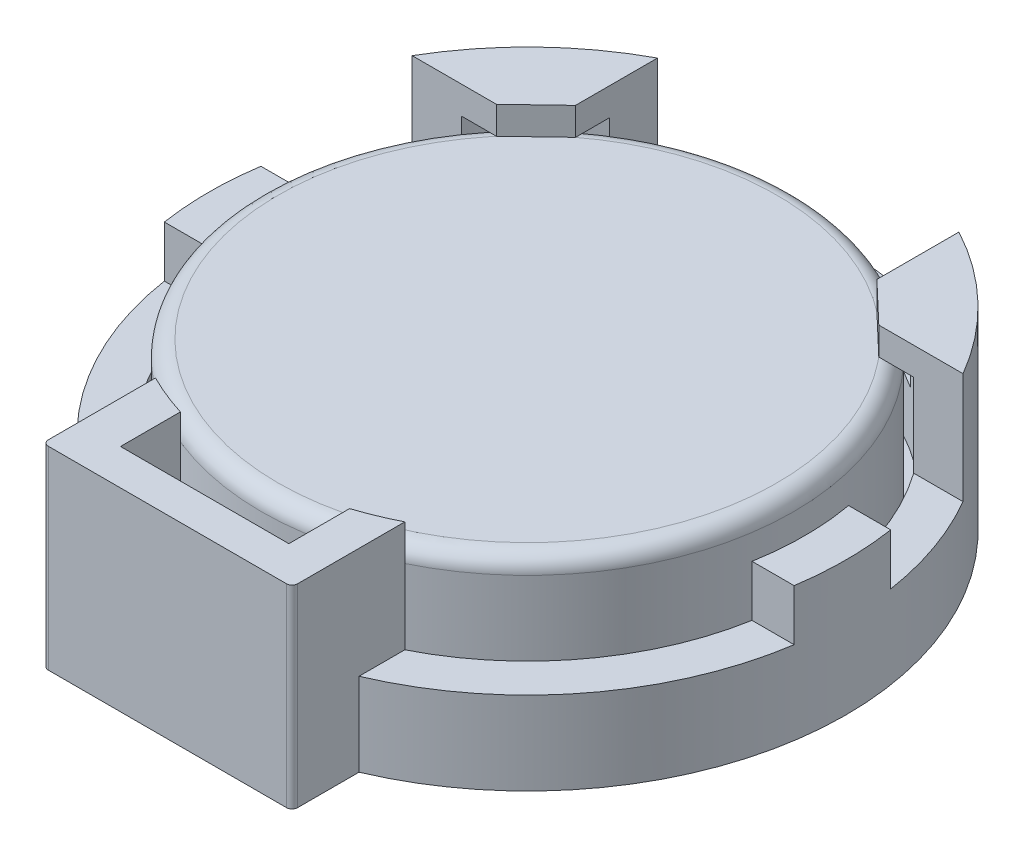
ISO-10303-21;
HEADER;
FILE_DESCRIPTION(('STEP AP214'),'2;1');
FILE_NAME('part.step','',(''),(''),'','','');
FILE_SCHEMA(('AUTOMOTIVE_DESIGN { 1 0 10303 214 1 1 1 1 }'));
ENDSEC;
DATA;
#1=APPLICATION_CONTEXT('core data for automotive mechanical design processes');
#2=APPLICATION_PROTOCOL_DEFINITION('international standard','automotive_design',2000,#1);
#3=PRODUCT_CONTEXT('',#1,'mechanical');
#4=PRODUCT('Part','Part','',(#3));
#5=PRODUCT_RELATED_PRODUCT_CATEGORY('part','',(#4));
#6=PRODUCT_DEFINITION_FORMATION('','',#4);
#7=PRODUCT_DEFINITION_CONTEXT('part definition',#1,'design');
#8=PRODUCT_DEFINITION('design','',#6,#7);
#9=PRODUCT_DEFINITION_SHAPE('','',#8);
#10=(LENGTH_UNIT() NAMED_UNIT(*) SI_UNIT(.MILLI.,.METRE.));
#11=(NAMED_UNIT(*) PLANE_ANGLE_UNIT() SI_UNIT($,.RADIAN.));
#12=(NAMED_UNIT(*) SI_UNIT($,.STERADIAN.) SOLID_ANGLE_UNIT());
#13=UNCERTAINTY_MEASURE_WITH_UNIT(LENGTH_MEASURE(1.E-05),#10,'distance_accuracy_value','');
#14=(GEOMETRIC_REPRESENTATION_CONTEXT(3) GLOBAL_UNCERTAINTY_ASSIGNED_CONTEXT((#13)) GLOBAL_UNIT_ASSIGNED_CONTEXT((#10,
#11,#12)) REPRESENTATION_CONTEXT('',''));
#15=CARTESIAN_POINT('',(0.,0.,0.));
#16=DIRECTION('',(0.,0.,1.));
#17=DIRECTION('',(1.,0.,0.));
#18=AXIS2_PLACEMENT_3D('',#15,#16,#17);
#19=CARTESIAN_POINT('',(0.,1.,0.));
#20=DIRECTION('',(0.,1.,0.));
#21=DIRECTION('',(0.,0.,1.));
#22=AXIS2_PLACEMENT_3D('',#19,#20,#21);
#23=CYLINDRICAL_SURFACE('',#22,10.);
#24=CARTESIAN_POINT('',(0.,1.,0.));
#25=DIRECTION('',(0.,1.,0.));
#26=DIRECTION('',(0.,0.,1.));
#27=AXIS2_PLACEMENT_3D('',#24,#25,#26);
#28=CIRCLE('',#27,10.);
#29=CARTESIAN_POINT('',(0.,1.,10.));
#30=VERTEX_POINT('',#29);
#31=EDGE_CURVE('E454',#30,#30,#28,.T.);
#32=ORIENTED_EDGE('',*,*,#31,.F.);
#33=EDGE_LOOP('',(#32));
#34=FACE_BOUND('',#33,.T.);
#35=CARTESIAN_POINT('',(0.,6.,0.));
#36=DIRECTION('',(0.,1.,0.));
#37=DIRECTION('',(0.,0.,1.));
#38=AXIS2_PLACEMENT_3D('',#35,#36,#37);
#39=CIRCLE('',#38,10.);
#40=CARTESIAN_POINT('',(8.16170008433562,6.,-5.77811835577604));
#41=VERTEX_POINT('',#40);
#42=CARTESIAN_POINT('',(5.44030687455703,6.,-8.39065319928357));
#43=VERTEX_POINT('',#42);
#44=EDGE_CURVE('E279',#41,#43,#39,.T.);
#45=ORIENTED_EDGE('',*,*,#44,.T.);
#46=DIRECTION('',(0.,1.,0.));
#47=VECTOR('',#46,1.);
#48=CARTESIAN_POINT('',(5.44030687455703,1.,-8.39065319928357));
#49=LINE('',#48,#47);
#50=CARTESIAN_POINT('',(5.44030687455703,3.,-8.39065319928357));
#51=VERTEX_POINT('',#50);
#52=EDGE_CURVE('E269',#43,#51,#49,.F.);
#53=ORIENTED_EDGE('',*,*,#52,.T.);
#54=CARTESIAN_POINT('',(0.,3.,0.));
#55=DIRECTION('',(0.,1.,0.));
#56=DIRECTION('',(0.,0.,1.));
#57=AXIS2_PLACEMENT_3D('',#54,#55,#56);
#58=CIRCLE('',#57,10.);
#59=CARTESIAN_POINT('',(-5.44030687455703,3.,-8.39065319928357));
#60=VERTEX_POINT('',#59);
#61=EDGE_CURVE('E277',#60,#51,#58,.F.);
#62=ORIENTED_EDGE('',*,*,#61,.F.);
#63=DIRECTION('',(0.,1.,0.));
#64=VECTOR('',#63,1.);
#65=CARTESIAN_POINT('',(-5.44030687455703,1.,-8.39065319928357));
#66=LINE('',#65,#64);
#67=CARTESIAN_POINT('',(-5.44030687455703,6.,-8.39065319928357));
#68=VERTEX_POINT('',#67);
#69=EDGE_CURVE('E68',#60,#68,#66,.T.);
#70=ORIENTED_EDGE('',*,*,#69,.T.);
#71=CARTESIAN_POINT('',(0.,6.,0.));
#72=DIRECTION('',(0.,1.,0.));
#73=DIRECTION('',(0.,0.,-1.));
#74=AXIS2_PLACEMENT_3D('',#71,#72,#73);
#75=CIRCLE('',#74,10.);
#76=CARTESIAN_POINT('',(-8.16170008433562,6.,-5.77811835577604));
#77=VERTEX_POINT('',#76);
#78=EDGE_CURVE('E302',#68,#77,#75,.T.);
#79=ORIENTED_EDGE('',*,*,#78,.T.);
#80=DIRECTION('',(0.,1.,0.));
#81=VECTOR('',#80,1.);
#82=CARTESIAN_POINT('',(-8.16170008433562,1.,-5.77811835577604));
#83=LINE('',#82,#81);
#84=CARTESIAN_POINT('',(-8.16170008433561,3.,-5.77811835577604));
#85=VERTEX_POINT('',#84);
#86=EDGE_CURVE('E473',#77,#85,#83,.F.);
#87=ORIENTED_EDGE('',*,*,#86,.T.);
#88=CARTESIAN_POINT('',(-9.84688215398306,3.,-1.74324749980313));
#89=VERTEX_POINT('',#88);
#90=EDGE_CURVE('E468',#89,#85,#58,.F.);
#91=ORIENTED_EDGE('',*,*,#90,.F.);
#92=DIRECTION('',(0.,1.,0.));
#93=VECTOR('',#92,1.);
#94=CARTESIAN_POINT('',(-9.84688215398306,1.,-1.74324749980313));
#95=LINE('',#94,#93);
#96=CARTESIAN_POINT('',(-9.84688215398307,4.84705488621152,-1.74324749980313));
#97=VERTEX_POINT('',#96);
#98=EDGE_CURVE('E475',#89,#97,#95,.T.);
#99=ORIENTED_EDGE('',*,*,#98,.T.);
#100=CARTESIAN_POINT('',(0.,4.84705488621152,0.));
#101=DIRECTION('',(0.,-1.,0.));
#102=DIRECTION('',(0.,0.,-1.));
#103=AXIS2_PLACEMENT_3D('',#100,#101,#102);
#104=CIRCLE('',#103,10.);
#105=CARTESIAN_POINT('',(-9.84688215398306,4.84705488621152,1.74324749980313));
#106=VERTEX_POINT('',#105);
#107=EDGE_CURVE('E386',#97,#106,#104,.F.);
#108=ORIENTED_EDGE('',*,*,#107,.T.);
#109=DIRECTION('',(0.,1.,0.));
#110=VECTOR('',#109,1.);
#111=CARTESIAN_POINT('',(-9.84688215398306,1.,1.74324749980313));
#112=LINE('',#111,#110);
#113=CARTESIAN_POINT('',(-9.84688215398306,3.,1.74324749980313));
#114=VERTEX_POINT('',#113);
#115=EDGE_CURVE('E486',#106,#114,#112,.F.);
#116=ORIENTED_EDGE('',*,*,#115,.T.);
#117=CARTESIAN_POINT('',(0.,3.,0.));
#118=DIRECTION('',(0.,1.,0.));
#119=DIRECTION('',(0.,0.,1.));
#120=AXIS2_PLACEMENT_3D('',#117,#118,#119);
#121=CIRCLE('',#120,10.);
#122=CARTESIAN_POINT('',(-4.5,3.,8.93028554974588));
#123=VERTEX_POINT('',#122);
#124=EDGE_CURVE('E478',#123,#114,#121,.F.);
#125=ORIENTED_EDGE('',*,*,#124,.F.);
#126=DIRECTION('',(0.,-1.,0.));
#127=VECTOR('',#126,1.);
#128=CARTESIAN_POINT('',(-4.5,7.,8.93028554974588));
#129=LINE('',#128,#127);
#130=CARTESIAN_POINT('',(-4.5,7.,8.93028554974588));
#131=VERTEX_POINT('',#130);
#132=EDGE_CURVE('E355',#131,#123,#129,.T.);
#133=ORIENTED_EDGE('',*,*,#132,.F.);
#134=CARTESIAN_POINT('',(0.,7.,0.));
#135=DIRECTION('',(0.,-1.,0.));
#136=DIRECTION('',(0.,0.,-1.));
#137=AXIS2_PLACEMENT_3D('',#134,#135,#136);
#138=CIRCLE('',#137,10.);
#139=CARTESIAN_POINT('',(-2.9884242853768,7.,9.54302469296659));
#140=VERTEX_POINT('',#139);
#141=EDGE_CURVE('E353',#140,#131,#138,.T.);
#142=ORIENTED_EDGE('',*,*,#141,.F.);
#143=DIRECTION('',(0.,-1.,0.));
#144=VECTOR('',#143,1.);
#145=CARTESIAN_POINT('',(-2.9884242853768,7.,9.54302469296659));
#146=LINE('',#145,#144);
#147=CARTESIAN_POINT('',(-2.9884242853768,3.,9.54302469296659));
#148=VERTEX_POINT('',#147);
#149=EDGE_CURVE('E358',#140,#148,#146,.T.);
#150=ORIENTED_EDGE('',*,*,#149,.T.);
#151=CARTESIAN_POINT('',(3.08803842822269,3.,9.51125747027279));
#152=VERTEX_POINT('',#151);
#153=EDGE_CURVE('E483',#152,#148,#121,.F.);
#154=ORIENTED_EDGE('',*,*,#153,.F.);
#155=DIRECTION('',(0.,-1.,0.));
#156=VECTOR('',#155,1.);
#157=CARTESIAN_POINT('',(3.08803842822269,7.,9.51125747027279));
#158=LINE('',#157,#156);
#159=CARTESIAN_POINT('',(3.08803842822269,7.,9.51125747027279));
#160=VERTEX_POINT('',#159);
#161=EDGE_CURVE('E366',#160,#152,#158,.T.);
#162=ORIENTED_EDGE('',*,*,#161,.F.);
#163=CARTESIAN_POINT('',(0.,7.,0.));
#164=DIRECTION('',(0.,-1.,0.));
#165=DIRECTION('',(0.,0.,-1.));
#166=AXIS2_PLACEMENT_3D('',#163,#164,#165);
#167=CIRCLE('',#166,10.);
#168=CARTESIAN_POINT('',(4.5,7.,8.93028554974588));
#169=VERTEX_POINT('',#168);
#170=EDGE_CURVE('E345',#169,#160,#167,.T.);
#171=ORIENTED_EDGE('',*,*,#170,.F.);
#172=DIRECTION('',(0.,-1.,0.));
#173=VECTOR('',#172,1.);
#174=CARTESIAN_POINT('',(4.5,7.,8.93028554974588));
#175=LINE('',#174,#173);
#176=CARTESIAN_POINT('',(4.5,3.,8.93028554974588));
#177=VERTEX_POINT('',#176);
#178=EDGE_CURVE('E368',#169,#177,#175,.T.);
#179=ORIENTED_EDGE('',*,*,#178,.T.);
#180=CARTESIAN_POINT('',(9.84688215398306,3.,1.74324749980313));
#181=VERTEX_POINT('',#180);
#182=EDGE_CURVE('E479',#181,#177,#121,.F.);
#183=ORIENTED_EDGE('',*,*,#182,.F.);
#184=DIRECTION('',(0.,1.,0.));
#185=VECTOR('',#184,1.);
#186=CARTESIAN_POINT('',(9.84688215398306,1.,1.74324749980313));
#187=LINE('',#186,#185);
#188=CARTESIAN_POINT('',(9.84688215398306,4.84705488621152,1.74324749980313));
#189=VERTEX_POINT('',#188);
#190=EDGE_CURVE('E482',#181,#189,#187,.T.);
#191=ORIENTED_EDGE('',*,*,#190,.T.);
#192=CARTESIAN_POINT('',(9.84688215398306,4.84705488621152,-1.74324749980313));
#193=VERTEX_POINT('',#192);
#194=EDGE_CURVE('E390',#189,#193,#104,.F.);
#195=ORIENTED_EDGE('',*,*,#194,.T.);
#196=DIRECTION('',(0.,1.,0.));
#197=VECTOR('',#196,1.);
#198=CARTESIAN_POINT('',(9.84688215398306,1.,-1.74324749980313));
#199=LINE('',#198,#197);
#200=CARTESIAN_POINT('',(9.84688215398306,3.,-1.74324749980313));
#201=VERTEX_POINT('',#200);
#202=EDGE_CURVE('E470',#193,#201,#199,.F.);
#203=ORIENTED_EDGE('',*,*,#202,.T.);
#204=CARTESIAN_POINT('',(8.16170008433562,3.,-5.77811835577604));
#205=VERTEX_POINT('',#204);
#206=EDGE_CURVE('E465',#205,#201,#58,.F.);
#207=ORIENTED_EDGE('',*,*,#206,.F.);
#208=DIRECTION('',(0.,1.,0.));
#209=VECTOR('',#208,1.);
#210=CARTESIAN_POINT('',(8.16170008433562,1.,-5.77811835577604));
#211=LINE('',#210,#209);
#212=EDGE_CURVE('E61',#205,#41,#211,.T.);
#213=ORIENTED_EDGE('',*,*,#212,.T.);
#214=EDGE_LOOP('',(#45,#53,#62,#70,#79,#87,#91,#99,#108,#116,#125,#133,#142,#150,#154,#162,#171,
#179,#183,#191,#195,#203,#207,#213));
#215=FACE_BOUND('',#214,.T.);
#216=ADVANCED_FACE('F46',(#34,#215),#23,.F.);
#217=CARTESIAN_POINT('',(0.,7.,0.));
#218=DIRECTION('',(0.,-1.,0.));
#219=DIRECTION('',(0.,0.,-1.));
#220=AXIS2_PLACEMENT_3D('',#217,#218,#219);
#221=CYLINDRICAL_SURFACE('',#220,11.5);
#222=DIRECTION('',(0.,-1.,0.));
#223=VECTOR('',#222,1.);
#224=CARTESIAN_POINT('',(-4.5,7.,10.5830052442584));
#225=LINE('',#224,#223);
#226=CARTESIAN_POINT('',(-4.5,3.,10.5830052442584));
#227=VERTEX_POINT('',#226);
#228=CARTESIAN_POINT('',(-4.5,0.,10.5830052442584));
#229=VERTEX_POINT('',#228);
#230=EDGE_CURVE('E378',#227,#229,#225,.T.);
#231=ORIENTED_EDGE('',*,*,#230,.F.);
#232=CARTESIAN_POINT('',(0.,3.,0.));
#233=DIRECTION('',(0.,1.,0.));
#234=DIRECTION('',(0.,0.,1.));
#235=AXIS2_PLACEMENT_3D('',#232,#233,#234);
#236=CIRCLE('',#235,11.5);
#237=CARTESIAN_POINT('',(-11.3671055310677,3.,1.74324749980313));
#238=VERTEX_POINT('',#237);
#239=EDGE_CURVE('E401',#238,#227,#236,.T.);
#240=ORIENTED_EDGE('',*,*,#239,.F.);
#241=DIRECTION('',(0.,-1.,0.));
#242=VECTOR('',#241,1.);
#243=CARTESIAN_POINT('',(-11.3671055310677,7.,1.74324749980313));
#244=LINE('',#243,#242);
#245=CARTESIAN_POINT('',(-11.3671055310677,4.84705488621152,1.74324749980313));
#246=VERTEX_POINT('',#245);
#247=EDGE_CURVE('E404',#238,#246,#244,.F.);
#248=ORIENTED_EDGE('',*,*,#247,.T.);
#249=CARTESIAN_POINT('',(0.,4.84705488621152,0.));
#250=DIRECTION('',(0.,-1.,0.));
#251=DIRECTION('',(0.,0.,-1.));
#252=AXIS2_PLACEMENT_3D('',#249,#250,#251);
#253=CIRCLE('',#252,11.5);
#254=CARTESIAN_POINT('',(-11.3671055310677,4.84705488621152,-1.74324749980313));
#255=VERTEX_POINT('',#254);
#256=EDGE_CURVE('E389',#246,#255,#253,.T.);
#257=ORIENTED_EDGE('',*,*,#256,.T.);
#258=DIRECTION('',(0.,-1.,0.));
#259=VECTOR('',#258,1.);
#260=CARTESIAN_POINT('',(-11.3671055310677,7.,-1.74324749980313));
#261=LINE('',#260,#259);
#262=CARTESIAN_POINT('',(-11.3671055310677,3.,-1.74324749980313));
#263=VERTEX_POINT('',#262);
#264=EDGE_CURVE('E452',#255,#263,#261,.T.);
#265=ORIENTED_EDGE('',*,*,#264,.T.);
#266=CARTESIAN_POINT('',(0.,3.,0.));
#267=DIRECTION('',(0.,1.,0.));
#268=DIRECTION('',(0.,0.,1.));
#269=AXIS2_PLACEMENT_3D('',#266,#267,#268);
#270=CIRCLE('',#269,11.5);
#271=CARTESIAN_POINT('',(-9.94300499178412,3.,-5.77811835577604));
#272=VERTEX_POINT('',#271);
#273=EDGE_CURVE('E432',#272,#263,#270,.T.);
#274=ORIENTED_EDGE('',*,*,#273,.F.);
#275=DIRECTION('',(0.,-1.,0.));
#276=VECTOR('',#275,1.);
#277=CARTESIAN_POINT('',(-9.94300499178412,7.,-5.77811835577604));
#278=LINE('',#277,#276);
#279=CARTESIAN_POINT('',(-9.94300499178412,7.,-5.77811835577604));
#280=VERTEX_POINT('',#279);
#281=EDGE_CURVE('E446',#272,#280,#278,.F.);
#282=ORIENTED_EDGE('',*,*,#281,.T.);
#283=CARTESIAN_POINT('',(0.,7.,0.));
#284=DIRECTION('',(0.,1.,0.));
#285=DIRECTION('',(0.,0.,1.));
#286=AXIS2_PLACEMENT_3D('',#283,#284,#285);
#287=CIRCLE('',#286,11.5);
#288=CARTESIAN_POINT('',(-5.44030687455703,7.,-10.1317846952374));
#289=VERTEX_POINT('',#288);
#290=EDGE_CURVE('E458',#289,#280,#287,.T.);
#291=ORIENTED_EDGE('',*,*,#290,.F.);
#292=DIRECTION('',(0.,-1.,0.));
#293=VECTOR('',#292,1.);
#294=CARTESIAN_POINT('',(-5.44030687455703,7.,-10.1317846952374));
#295=LINE('',#294,#293);
#296=CARTESIAN_POINT('',(-5.44030687455703,3.,-10.1317846952374));
#297=VERTEX_POINT('',#296);
#298=EDGE_CURVE('E443',#289,#297,#295,.T.);
#299=ORIENTED_EDGE('',*,*,#298,.T.);
#300=CARTESIAN_POINT('',(5.44030687455703,3.,-10.1317846952374));
#301=VERTEX_POINT('',#300);
#302=EDGE_CURVE('E435',#301,#297,#270,.T.);
#303=ORIENTED_EDGE('',*,*,#302,.F.);
#304=DIRECTION('',(0.,-1.,0.));
#305=VECTOR('',#304,1.);
#306=CARTESIAN_POINT('',(5.44030687455703,7.,-10.1317846952374));
#307=LINE('',#306,#305);
#308=CARTESIAN_POINT('',(5.44030687455703,7.,-10.1317846952374));
#309=VERTEX_POINT('',#308);
#310=EDGE_CURVE('E440',#301,#309,#307,.F.);
#311=ORIENTED_EDGE('',*,*,#310,.T.);
#312=CARTESIAN_POINT('',(9.94300499178412,7.,-5.77811835577604));
#313=VERTEX_POINT('',#312);
#314=EDGE_CURVE('E461',#313,#309,#287,.T.);
#315=ORIENTED_EDGE('',*,*,#314,.F.);
#316=DIRECTION('',(0.,-1.,0.));
#317=VECTOR('',#316,1.);
#318=CARTESIAN_POINT('',(9.94300499178412,7.,-5.77811835577604));
#319=LINE('',#318,#317);
#320=CARTESIAN_POINT('',(9.94300499178412,3.,-5.77811835577604));
#321=VERTEX_POINT('',#320);
#322=EDGE_CURVE('E437',#313,#321,#319,.T.);
#323=ORIENTED_EDGE('',*,*,#322,.T.);
#324=CARTESIAN_POINT('',(11.3671055310677,3.,-1.74324749980313));
#325=VERTEX_POINT('',#324);
#326=EDGE_CURVE('E436',#325,#321,#270,.T.);
#327=ORIENTED_EDGE('',*,*,#326,.F.);
#328=DIRECTION('',(0.,-1.,0.));
#329=VECTOR('',#328,1.);
#330=CARTESIAN_POINT('',(11.3671055310677,7.,-1.74324749980313));
#331=LINE('',#330,#329);
#332=CARTESIAN_POINT('',(11.3671055310677,4.84705488621152,-1.74324749980313));
#333=VERTEX_POINT('',#332);
#334=EDGE_CURVE('E449',#325,#333,#331,.F.);
#335=ORIENTED_EDGE('',*,*,#334,.T.);
#336=CARTESIAN_POINT('',(11.3671055310677,4.84705488621152,1.74324749980313));
#337=VERTEX_POINT('',#336);
#338=EDGE_CURVE('E394',#333,#337,#253,.T.);
#339=ORIENTED_EDGE('',*,*,#338,.T.);
#340=DIRECTION('',(0.,-1.,0.));
#341=VECTOR('',#340,1.);
#342=CARTESIAN_POINT('',(11.3671055310677,7.,1.74324749980313));
#343=LINE('',#342,#341);
#344=CARTESIAN_POINT('',(11.3671055310677,3.,1.74324749980313));
#345=VERTEX_POINT('',#344);
#346=EDGE_CURVE('E409',#337,#345,#343,.T.);
#347=ORIENTED_EDGE('',*,*,#346,.T.);
#348=CARTESIAN_POINT('',(4.5,3.,10.5830052442584));
#349=VERTEX_POINT('',#348);
#350=EDGE_CURVE('E406',#349,#345,#236,.T.);
#351=ORIENTED_EDGE('',*,*,#350,.F.);
#352=DIRECTION('',(0.,-1.,0.));
#353=VECTOR('',#352,1.);
#354=CARTESIAN_POINT('',(4.5,7.,10.5830052442584));
#355=LINE('',#354,#353);
#356=CARTESIAN_POINT('',(4.5,0.,10.5830052442584));
#357=VERTEX_POINT('',#356);
#358=EDGE_CURVE('E376',#357,#349,#355,.F.);
#359=ORIENTED_EDGE('',*,*,#358,.F.);
#360=CARTESIAN_POINT('',(0.,0.,0.));
#361=DIRECTION('',(0.,1.,0.));
#362=DIRECTION('',(0.,0.,1.));
#363=AXIS2_PLACEMENT_3D('',#360,#361,#362);
#364=CIRCLE('',#363,11.5);
#365=EDGE_CURVE('E462',#357,#229,#364,.T.);
#366=ORIENTED_EDGE('',*,*,#365,.T.);
#367=EDGE_LOOP('',(#231,#240,#248,#257,#265,#274,#282,#291,#299,#303,#311,#315,#323,#327,#335,
#339,#347,#351,#359,#366));
#368=FACE_BOUND('',#367,.T.);
#369=ADVANCED_FACE('F548',(#368),#221,.T.);
#370=DIRECTION('',(0.,-1.,0.));
#371=VECTOR('',#370,1.);
#372=CARTESIAN_POINT('',(3.08803842822269,7.,11.0776359691867));
#373=LINE('',#372,#371);
#374=CARTESIAN_POINT('',(3.08803842822269,3.,11.0776359691867));
#375=VERTEX_POINT('',#374);
#376=CARTESIAN_POINT('',(3.08803842822269,0.,11.0776359691867));
#377=VERTEX_POINT('',#376);
#378=EDGE_CURVE('E374',#375,#377,#373,.T.);
#379=ORIENTED_EDGE('',*,*,#378,.F.);
#380=CARTESIAN_POINT('',(-2.9884242853768,3.,11.1049232455956));
#381=VERTEX_POINT('',#380);
#382=EDGE_CURVE('E405',#381,#375,#236,.T.);
#383=ORIENTED_EDGE('',*,*,#382,.F.);
#384=DIRECTION('',(0.,-1.,0.));
#385=VECTOR('',#384,1.);
#386=CARTESIAN_POINT('',(-2.9884242853768,7.,11.1049232455956));
#387=LINE('',#386,#385);
#388=CARTESIAN_POINT('',(-2.9884242853768,0.,11.1049232455956));
#389=VERTEX_POINT('',#388);
#390=EDGE_CURVE('E371',#389,#381,#387,.F.);
#391=ORIENTED_EDGE('',*,*,#390,.F.);
#392=EDGE_CURVE('E457',#389,#377,#364,.T.);
#393=ORIENTED_EDGE('',*,*,#392,.T.);
#394=EDGE_LOOP('',(#379,#383,#391,#393));
#395=FACE_BOUND('',#394,.T.);
#396=ADVANCED_FACE('F616',(#395),#221,.T.);
#397=CARTESIAN_POINT('',(-12.6011890700055,3.,1.74324749980313));
#398=DIRECTION('',(0.,1.,0.));
#399=DIRECTION('',(0.,0.,1.));
#400=AXIS2_PLACEMENT_3D('',#397,#398,#399);
#401=PLANE('',#400);
#402=ORIENTED_EDGE('',*,*,#239,.T.);
#403=DIRECTION('',(0.,0.,-1.));
#404=VECTOR('',#403,1.);
#405=CARTESIAN_POINT('',(-4.5,3.,1.74324749980313));
#406=LINE('',#405,#404);
#407=EDGE_CURVE('E500',#227,#123,#406,.T.);
#408=ORIENTED_EDGE('',*,*,#407,.T.);
#409=ORIENTED_EDGE('',*,*,#124,.T.);
#410=DIRECTION('',(-1.,0.,0.));
#411=VECTOR('',#410,1.);
#412=CARTESIAN_POINT('',(12.0533112843531,3.,1.74324749980313));
#413=LINE('',#412,#411);
#414=EDGE_CURVE('E397',#114,#238,#413,.T.);
#415=ORIENTED_EDGE('',*,*,#414,.T.);
#416=EDGE_LOOP('',(#402,#408,#409,#415));
#417=FACE_BOUND('',#416,.T.);
#418=ADVANCED_FACE('F551',(#417),#401,.T.);
#419=ORIENTED_EDGE('',*,*,#182,.T.);
#420=DIRECTION('',(0.,0.,1.));
#421=VECTOR('',#420,1.);
#422=CARTESIAN_POINT('',(4.5,3.,1.74324749980313));
#423=LINE('',#422,#421);
#424=EDGE_CURVE('E497',#177,#349,#423,.T.);
#425=ORIENTED_EDGE('',*,*,#424,.T.);
#426=ORIENTED_EDGE('',*,*,#350,.T.);
#427=EDGE_CURVE('E400',#345,#181,#413,.T.);
#428=ORIENTED_EDGE('',*,*,#427,.T.);
#429=EDGE_LOOP('',(#419,#425,#426,#428));
#430=FACE_BOUND('',#429,.T.);
#431=ADVANCED_FACE('F661',(#430),#401,.T.);
#432=ORIENTED_EDGE('',*,*,#382,.T.);
#433=DIRECTION('',(0.,0.,-1.));
#434=VECTOR('',#433,1.);
#435=CARTESIAN_POINT('',(3.08803842822269,3.,1.74324749980313));
#436=LINE('',#435,#434);
#437=EDGE_CURVE('E494',#375,#152,#436,.T.);
#438=ORIENTED_EDGE('',*,*,#437,.T.);
#439=ORIENTED_EDGE('',*,*,#153,.T.);
#440=DIRECTION('',(0.,0.,1.));
#441=VECTOR('',#440,1.);
#442=CARTESIAN_POINT('',(-2.9884242853768,3.,1.74324749980313));
#443=LINE('',#442,#441);
#444=EDGE_CURVE('E492',#148,#381,#443,.T.);
#445=ORIENTED_EDGE('',*,*,#444,.T.);
#446=EDGE_LOOP('',(#432,#438,#439,#445));
#447=FACE_BOUND('',#446,.T.);
#448=ADVANCED_FACE('F662',(#447),#401,.T.);
#449=CARTESIAN_POINT('',(0.,7.,0.));
#450=DIRECTION('',(0.,1.,0.));
#451=DIRECTION('',(0.,0.,1.));
#452=AXIS2_PLACEMENT_3D('',#449,#450,#451);
#453=PLANE('',#452);
#454=DIRECTION('',(-1.,0.,0.));
#455=VECTOR('',#454,1.);
#456=CARTESIAN_POINT('',(-12.6011890700055,7.,-5.77811835577604));
#457=LINE('',#456,#455);
#458=CARTESIAN_POINT('',(-6.90165533026126,7.,-5.77811835577604));
#459=VERTEX_POINT('',#458);
#460=EDGE_CURVE('E415',#459,#280,#457,.T.);
#461=ORIENTED_EDGE('',*,*,#460,.F.);
#462=DIRECTION('',(0.723872275431072,0.,-0.689934003265706));
#463=VECTOR('',#462,1.);
#464=CARTESIAN_POINT('',(-6.90165533026126,7.,-5.77811835577604));
#465=LINE('',#464,#463);
#466=CARTESIAN_POINT('',(-5.44030687455703,7.,-7.17095245708178));
#467=VERTEX_POINT('',#466);
#468=EDGE_CURVE('E300',#459,#467,#465,.T.);
#469=ORIENTED_EDGE('',*,*,#468,.T.);
#470=DIRECTION('',(0.,0.,1.));
#471=VECTOR('',#470,1.);
#472=CARTESIAN_POINT('',(-5.44030687455703,7.,-5.77811835577604));
#473=LINE('',#472,#471);
#474=EDGE_CURVE('E429',#289,#467,#473,.T.);
#475=ORIENTED_EDGE('',*,*,#474,.F.);
#476=ORIENTED_EDGE('',*,*,#290,.T.);
#477=EDGE_LOOP('',(#461,#469,#475,#476));
#478=FACE_BOUND('',#477,.T.);
#479=ADVANCED_FACE('F572',(#478),#453,.T.);
#480=DIRECTION('',(0.,0.,-1.));
#481=VECTOR('',#480,1.);
#482=CARTESIAN_POINT('',(5.44030687455703,7.,-5.77811835577604));
#483=LINE('',#482,#481);
#484=CARTESIAN_POINT('',(5.44030687455703,7.,-7.17095245708178));
#485=VERTEX_POINT('',#484);
#486=EDGE_CURVE('E427',#485,#309,#483,.T.);
#487=ORIENTED_EDGE('',*,*,#486,.F.);
#488=DIRECTION('',(0.723872275431072,0.,0.689934003265706));
#489=VECTOR('',#488,1.);
#490=CARTESIAN_POINT('',(6.90165533026126,7.,-5.77811835577604));
#491=LINE('',#490,#489);
#492=CARTESIAN_POINT('',(6.90165533026126,7.,-5.77811835577604));
#493=VERTEX_POINT('',#492);
#494=EDGE_CURVE('E283',#485,#493,#491,.T.);
#495=ORIENTED_EDGE('',*,*,#494,.T.);
#496=DIRECTION('',(-1.,0.,0.));
#497=VECTOR('',#496,1.);
#498=CARTESIAN_POINT('',(12.0533112843531,7.,-5.77811835577604));
#499=LINE('',#498,#497);
#500=EDGE_CURVE('E412',#313,#493,#499,.T.);
#501=ORIENTED_EDGE('',*,*,#500,.F.);
#502=ORIENTED_EDGE('',*,*,#314,.T.);
#503=EDGE_LOOP('',(#487,#495,#501,#502));
#504=FACE_BOUND('',#503,.T.);
#505=ADVANCED_FACE('F598',(#504),#453,.T.);
#506=CARTESIAN_POINT('',(0.,0.,0.));
#507=DIRECTION('',(0.,1.,0.));
#508=DIRECTION('',(0.,0.,1.));
#509=AXIS2_PLACEMENT_3D('',#506,#507,#508);
#510=PLANE('',#509);
#511=DIRECTION('',(0.,0.,-1.));
#512=VECTOR('',#511,1.);
#513=CARTESIAN_POINT('',(4.5,0.,8.93028554974588));
#514=LINE('',#513,#512);
#515=CARTESIAN_POINT('',(4.5,0.,12.8));
#516=VERTEX_POINT('',#515);
#517=EDGE_CURVE('E327',#516,#357,#514,.T.);
#518=ORIENTED_EDGE('',*,*,#517,.F.);
#519=CARTESIAN_POINT('',(4.3,0.,12.8));
#520=DIRECTION('',(0.,1.,0.));
#521=DIRECTION('',(0.,0.,1.));
#522=AXIS2_PLACEMENT_3D('',#519,#520,#521);
#523=CIRCLE('',#522,0.2);
#524=CARTESIAN_POINT('',(4.3,0.,13.));
#525=VERTEX_POINT('',#524);
#526=EDGE_CURVE('E508',#516,#525,#523,.F.);
#527=ORIENTED_EDGE('',*,*,#526,.T.);
#528=DIRECTION('',(1.,0.,0.));
#529=VECTOR('',#528,1.);
#530=CARTESIAN_POINT('',(4.5,0.,13.));
#531=LINE('',#530,#529);
#532=CARTESIAN_POINT('',(-4.3,0.,13.));
#533=VERTEX_POINT('',#532);
#534=EDGE_CURVE('E324',#533,#525,#531,.T.);
#535=ORIENTED_EDGE('',*,*,#534,.F.);
#536=CARTESIAN_POINT('',(-4.3,0.,12.8));
#537=DIRECTION('',(0.,1.,0.));
#538=DIRECTION('',(0.,0.,1.));
#539=AXIS2_PLACEMENT_3D('',#536,#537,#538);
#540=CIRCLE('',#539,0.2);
#541=CARTESIAN_POINT('',(-4.5,0.,12.8));
#542=VERTEX_POINT('',#541);
#543=EDGE_CURVE('E506',#533,#542,#540,.F.);
#544=ORIENTED_EDGE('',*,*,#543,.T.);
#545=DIRECTION('',(0.,0.,1.));
#546=VECTOR('',#545,1.);
#547=CARTESIAN_POINT('',(-4.5,0.,8.93028554974588));
#548=LINE('',#547,#546);
#549=EDGE_CURVE('E319',#229,#542,#548,.T.);
#550=ORIENTED_EDGE('',*,*,#549,.F.);
#551=ORIENTED_EDGE('',*,*,#365,.F.);
#552=EDGE_LOOP('',(#518,#527,#535,#544,#550,#551));
#553=FACE_BOUND('',#552,.T.);
#554=DIRECTION('',(0.,0.,1.));
#555=VECTOR('',#554,1.);
#556=CARTESIAN_POINT('',(3.08803842822269,0.,9.51125747027279));
#557=LINE('',#556,#555);
#558=CARTESIAN_POINT('',(3.08803842822269,0.,11.7046617843925));
#559=VERTEX_POINT('',#558);
#560=EDGE_CURVE('E329',#377,#559,#557,.T.);
#561=ORIENTED_EDGE('',*,*,#560,.F.);
#562=ORIENTED_EDGE('',*,*,#392,.F.);
#563=DIRECTION('',(0.,0.,-1.));
#564=VECTOR('',#563,1.);
#565=CARTESIAN_POINT('',(-2.9884242853768,0.,9.54302469296659));
#566=LINE('',#565,#564);
#567=CARTESIAN_POINT('',(-2.9884242853768,0.,11.7046617843925));
#568=VERTEX_POINT('',#567);
#569=EDGE_CURVE('E334',#568,#389,#566,.T.);
#570=ORIENTED_EDGE('',*,*,#569,.F.);
#571=DIRECTION('',(-1.,0.,0.));
#572=VECTOR('',#571,1.);
#573=CARTESIAN_POINT('',(3.08803842822269,0.,11.7046617843925));
#574=LINE('',#573,#572);
#575=EDGE_CURVE('E331',#559,#568,#574,.T.);
#576=ORIENTED_EDGE('',*,*,#575,.F.);
#577=EDGE_LOOP('',(#561,#562,#570,#576));
#578=FACE_BOUND('',#577,.T.);
#579=ADVANCED_FACE('F532',(#553,#578),#510,.F.);
#580=CARTESIAN_POINT('',(0.,1.,0.));
#581=DIRECTION('',(0.,1.,0.));
#582=DIRECTION('',(0.,0.,1.));
#583=AXIS2_PLACEMENT_3D('',#580,#581,#582);
#584=PLANE('',#583);
#585=ORIENTED_EDGE('',*,*,#31,.T.);
#586=EDGE_LOOP('',(#585));
#587=FACE_BOUND('',#586,.T.);
#588=ADVANCED_FACE('F621',(#587),#584,.T.);
#589=CARTESIAN_POINT('',(12.0533112843531,3.,-12.6509961414285));
#590=DIRECTION('',(0.,1.,0.));
#591=DIRECTION('',(0.,0.,1.));
#592=AXIS2_PLACEMENT_3D('',#589,#590,#591);
#593=PLANE('',#592);
#594=ORIENTED_EDGE('',*,*,#326,.T.);
#595=DIRECTION('',(-1.,0.,0.));
#596=VECTOR('',#595,1.);
#597=CARTESIAN_POINT('',(12.0533112843531,3.,-5.77811835577604));
#598=LINE('',#597,#596);
#599=EDGE_CURVE('E413',#321,#205,#598,.T.);
#600=ORIENTED_EDGE('',*,*,#599,.T.);
#601=ORIENTED_EDGE('',*,*,#206,.T.);
#602=DIRECTION('',(1.,0.,0.));
#603=VECTOR('',#602,1.);
#604=CARTESIAN_POINT('',(12.0533112843531,3.,-1.74324749980313));
#605=LINE('',#604,#603);
#606=EDGE_CURVE('E422',#201,#325,#605,.T.);
#607=ORIENTED_EDGE('',*,*,#606,.T.);
#608=EDGE_LOOP('',(#594,#600,#601,#607));
#609=FACE_BOUND('',#608,.T.);
#610=ADVANCED_FACE('F590',(#609),#593,.T.);
#611=CARTESIAN_POINT('',(12.0533112843531,3.,-5.77811835577604));
#612=DIRECTION('',(0.,0.,-1.));
#613=DIRECTION('',(-1.,0.,0.));
#614=AXIS2_PLACEMENT_3D('',#611,#612,#613);
#615=PLANE('',#614);
#616=ORIENTED_EDGE('',*,*,#500,.T.);
#617=DIRECTION('',(0.,1.,0.));
#618=VECTOR('',#617,1.);
#619=CARTESIAN_POINT('',(6.90165533026126,6.,-5.77811835577604));
#620=LINE('',#619,#618);
#621=CARTESIAN_POINT('',(6.90165533026126,6.,-5.77811835577604));
#622=VERTEX_POINT('',#621);
#623=EDGE_CURVE('E297',#622,#493,#620,.T.);
#624=ORIENTED_EDGE('',*,*,#623,.F.);
#625=DIRECTION('',(1.,0.,0.));
#626=VECTOR('',#625,1.);
#627=CARTESIAN_POINT('',(8.16170008433562,6.,-5.77811835577604));
#628=LINE('',#627,#626);
#629=EDGE_CURVE('E290',#622,#41,#628,.T.);
#630=ORIENTED_EDGE('',*,*,#629,.T.);
#631=ORIENTED_EDGE('',*,*,#212,.F.);
#632=ORIENTED_EDGE('',*,*,#599,.F.);
#633=ORIENTED_EDGE('',*,*,#322,.F.);
#634=EDGE_LOOP('',(#616,#624,#630,#631,#632,#633));
#635=FACE_BOUND('',#634,.T.);
#636=ADVANCED_FACE('F593',(#635),#615,.F.);
#637=CARTESIAN_POINT('',(12.0533112843531,3.,-1.74324749980313));
#638=DIRECTION('',(0.,0.,1.));
#639=DIRECTION('',(1.,0.,0.));
#640=AXIS2_PLACEMENT_3D('',#637,#638,#639);
#641=PLANE('',#640);
#642=ORIENTED_EDGE('',*,*,#202,.F.);
#643=DIRECTION('',(1.,0.,0.));
#644=VECTOR('',#643,1.);
#645=CARTESIAN_POINT('',(12.0533112843531,4.84705488621152,-1.74324749980313));
#646=LINE('',#645,#644);
#647=EDGE_CURVE('E393',#193,#333,#646,.T.);
#648=ORIENTED_EDGE('',*,*,#647,.T.);
#649=ORIENTED_EDGE('',*,*,#334,.F.);
#650=ORIENTED_EDGE('',*,*,#606,.F.);
#651=EDGE_LOOP('',(#642,#648,#649,#650));
#652=FACE_BOUND('',#651,.T.);
#653=ADVANCED_FACE('F672',(#652),#641,.F.);
#654=ORIENTED_EDGE('',*,*,#302,.T.);
#655=DIRECTION('',(0.,0.,1.));
#656=VECTOR('',#655,1.);
#657=CARTESIAN_POINT('',(-5.44030687455703,3.,-5.77811835577604));
#658=LINE('',#657,#656);
#659=EDGE_CURVE('E417',#297,#60,#658,.T.);
#660=ORIENTED_EDGE('',*,*,#659,.T.);
#661=ORIENTED_EDGE('',*,*,#61,.T.);
#662=DIRECTION('',(0.,0.,-1.));
#663=VECTOR('',#662,1.);
#664=CARTESIAN_POINT('',(5.44030687455703,3.,-5.77811835577604));
#665=LINE('',#664,#663);
#666=EDGE_CURVE('E275',#51,#301,#665,.T.);
#667=ORIENTED_EDGE('',*,*,#666,.T.);
#668=EDGE_LOOP('',(#654,#660,#661,#667));
#669=FACE_BOUND('',#668,.T.);
#670=ADVANCED_FACE('F585',(#669),#593,.T.);
#671=CARTESIAN_POINT('',(5.44030687455703,3.,-5.77811835577604));
#672=DIRECTION('',(1.,0.,0.));
#673=DIRECTION('',(0.,0.,-1.));
#674=AXIS2_PLACEMENT_3D('',#671,#672,#673);
#675=PLANE('',#674);
#676=ORIENTED_EDGE('',*,*,#666,.F.);
#677=ORIENTED_EDGE('',*,*,#52,.F.);
#678=DIRECTION('',(0.,0.,1.));
#679=VECTOR('',#678,1.);
#680=CARTESIAN_POINT('',(5.44030687455703,6.,-8.39065319928357));
#681=LINE('',#680,#679);
#682=CARTESIAN_POINT('',(5.44030687455703,6.,-7.17095245708178));
#683=VERTEX_POINT('',#682);
#684=EDGE_CURVE('E273',#43,#683,#681,.T.);
#685=ORIENTED_EDGE('',*,*,#684,.T.);
#686=DIRECTION('',(0.,1.,0.));
#687=VECTOR('',#686,1.);
#688=CARTESIAN_POINT('',(5.44030687455703,6.,-7.17095245708178));
#689=LINE('',#688,#687);
#690=EDGE_CURVE('E294',#683,#485,#689,.T.);
#691=ORIENTED_EDGE('',*,*,#690,.T.);
#692=ORIENTED_EDGE('',*,*,#486,.T.);
#693=ORIENTED_EDGE('',*,*,#310,.F.);
#694=EDGE_LOOP('',(#676,#677,#685,#691,#692,#693));
#695=FACE_BOUND('',#694,.T.);
#696=ADVANCED_FACE('F270',(#695),#675,.F.);
#697=CARTESIAN_POINT('',(-5.44030687455703,3.,-5.77811835577604));
#698=DIRECTION('',(-1.,0.,0.));
#699=DIRECTION('',(0.,0.,1.));
#700=AXIS2_PLACEMENT_3D('',#697,#698,#699);
#701=PLANE('',#700);
#702=ORIENTED_EDGE('',*,*,#474,.T.);
#703=DIRECTION('',(0.,1.,0.));
#704=VECTOR('',#703,1.);
#705=CARTESIAN_POINT('',(-5.44030687455703,6.,-7.17095245708178));
#706=LINE('',#705,#704);
#707=CARTESIAN_POINT('',(-5.44030687455703,6.,-7.17095245708178));
#708=VERTEX_POINT('',#707);
#709=EDGE_CURVE('E316',#708,#467,#706,.T.);
#710=ORIENTED_EDGE('',*,*,#709,.F.);
#711=DIRECTION('',(0.,0.,-1.));
#712=VECTOR('',#711,1.);
#713=CARTESIAN_POINT('',(-5.44030687455703,6.,-8.39065319928357));
#714=LINE('',#713,#712);
#715=EDGE_CURVE('E310',#708,#68,#714,.T.);
#716=ORIENTED_EDGE('',*,*,#715,.T.);
#717=ORIENTED_EDGE('',*,*,#69,.F.);
#718=ORIENTED_EDGE('',*,*,#659,.F.);
#719=ORIENTED_EDGE('',*,*,#298,.F.);
#720=EDGE_LOOP('',(#702,#710,#716,#717,#718,#719));
#721=FACE_BOUND('',#720,.T.);
#722=ADVANCED_FACE('F575',(#721),#701,.F.);
#723=ORIENTED_EDGE('',*,*,#264,.F.);
#724=DIRECTION('',(1.,0.,0.));
#725=VECTOR('',#724,1.);
#726=CARTESIAN_POINT('',(12.0533112843531,4.84705488621152,-1.74324749980313));
#727=LINE('',#726,#725);
#728=EDGE_CURVE('E383',#255,#97,#727,.T.);
#729=ORIENTED_EDGE('',*,*,#728,.T.);
#730=ORIENTED_EDGE('',*,*,#98,.F.);
#731=EDGE_CURVE('E425',#263,#89,#605,.T.);
#732=ORIENTED_EDGE('',*,*,#731,.F.);
#733=EDGE_LOOP('',(#723,#729,#730,#732));
#734=FACE_BOUND('',#733,.T.);
#735=ADVANCED_FACE('F561',(#734),#641,.F.);
#736=CARTESIAN_POINT('',(-12.6011890700055,3.,-5.77811835577604));
#737=DIRECTION('',(0.,0.,-1.));
#738=DIRECTION('',(-1.,0.,0.));
#739=AXIS2_PLACEMENT_3D('',#736,#737,#738);
#740=PLANE('',#739);
#741=DIRECTION('',(-1.,0.,0.));
#742=VECTOR('',#741,1.);
#743=CARTESIAN_POINT('',(-12.6011890700055,3.,-5.77811835577604));
#744=LINE('',#743,#742);
#745=EDGE_CURVE('E419',#85,#272,#744,.T.);
#746=ORIENTED_EDGE('',*,*,#745,.F.);
#747=ORIENTED_EDGE('',*,*,#86,.F.);
#748=DIRECTION('',(1.,0.,0.));
#749=VECTOR('',#748,1.);
#750=CARTESIAN_POINT('',(-8.16170008433562,6.,-5.77811835577604));
#751=LINE('',#750,#749);
#752=CARTESIAN_POINT('',(-6.90165533026126,6.,-5.77811835577604));
#753=VERTEX_POINT('',#752);
#754=EDGE_CURVE('E304',#77,#753,#751,.T.);
#755=ORIENTED_EDGE('',*,*,#754,.T.);
#756=DIRECTION('',(0.,1.,0.));
#757=VECTOR('',#756,1.);
#758=CARTESIAN_POINT('',(-6.90165533026126,6.,-5.77811835577604));
#759=LINE('',#758,#757);
#760=EDGE_CURVE('E313',#753,#459,#759,.T.);
#761=ORIENTED_EDGE('',*,*,#760,.T.);
#762=ORIENTED_EDGE('',*,*,#460,.T.);
#763=ORIENTED_EDGE('',*,*,#281,.F.);
#764=EDGE_LOOP('',(#746,#747,#755,#761,#762,#763));
#765=FACE_BOUND('',#764,.T.);
#766=ADVANCED_FACE('F671',(#765),#740,.F.);
#767=ORIENTED_EDGE('',*,*,#273,.T.);
#768=ORIENTED_EDGE('',*,*,#731,.T.);
#769=ORIENTED_EDGE('',*,*,#90,.T.);
#770=ORIENTED_EDGE('',*,*,#745,.T.);
#771=EDGE_LOOP('',(#767,#768,#769,#770));
#772=FACE_BOUND('',#771,.T.);
#773=ADVANCED_FACE('F566',(#772),#593,.T.);
#774=CARTESIAN_POINT('',(12.0533112843531,3.,1.74324749980313));
#775=DIRECTION('',(0.,0.,-1.));
#776=DIRECTION('',(-1.,0.,0.));
#777=AXIS2_PLACEMENT_3D('',#774,#775,#776);
#778=PLANE('',#777);
#779=ORIENTED_EDGE('',*,*,#346,.F.);
#780=DIRECTION('',(1.,0.,0.));
#781=VECTOR('',#780,1.);
#782=CARTESIAN_POINT('',(12.0465194109772,4.84705488621152,1.74324749980313));
#783=LINE('',#782,#781);
#784=EDGE_CURVE('E381',#189,#337,#783,.T.);
#785=ORIENTED_EDGE('',*,*,#784,.F.);
#786=ORIENTED_EDGE('',*,*,#190,.F.);
#787=ORIENTED_EDGE('',*,*,#427,.F.);
#788=EDGE_LOOP('',(#779,#785,#786,#787));
#789=FACE_BOUND('',#788,.T.);
#790=ADVANCED_FACE('F663',(#789),#778,.F.);
#791=ORIENTED_EDGE('',*,*,#115,.F.);
#792=DIRECTION('',(-1.,0.,0.));
#793=VECTOR('',#792,1.);
#794=CARTESIAN_POINT('',(12.0533112843531,4.84705488621152,1.74324749980313));
#795=LINE('',#794,#793);
#796=EDGE_CURVE('E489',#106,#246,#795,.T.);
#797=ORIENTED_EDGE('',*,*,#796,.T.);
#798=ORIENTED_EDGE('',*,*,#247,.F.);
#799=ORIENTED_EDGE('',*,*,#414,.F.);
#800=EDGE_LOOP('',(#791,#797,#798,#799));
#801=FACE_BOUND('',#800,.T.);
#802=ADVANCED_FACE('F555',(#801),#778,.F.);
#803=CARTESIAN_POINT('',(12.0465194109772,4.84705488621152,-2.25675250019687));
#804=DIRECTION('',(0.,-1.,0.));
#805=DIRECTION('',(0.,0.,-1.));
#806=AXIS2_PLACEMENT_3D('',#803,#804,#805);
#807=PLANE('',#806);
#808=ORIENTED_EDGE('',*,*,#796,.F.);
#809=ORIENTED_EDGE('',*,*,#107,.F.);
#810=ORIENTED_EDGE('',*,*,#728,.F.);
#811=ORIENTED_EDGE('',*,*,#256,.F.);
#812=EDGE_LOOP('',(#808,#809,#810,#811));
#813=FACE_BOUND('',#812,.T.);
#814=ADVANCED_FACE('F657',(#813),#807,.F.);
#815=ORIENTED_EDGE('',*,*,#647,.F.);
#816=ORIENTED_EDGE('',*,*,#194,.F.);
#817=ORIENTED_EDGE('',*,*,#784,.T.);
#818=ORIENTED_EDGE('',*,*,#338,.F.);
#819=EDGE_LOOP('',(#815,#816,#817,#818));
#820=FACE_BOUND('',#819,.T.);
#821=ADVANCED_FACE('F654',(#820),#807,.F.);
#822=CARTESIAN_POINT('',(-4.5,7.,8.93028554974588));
#823=DIRECTION('',(1.,0.,0.));
#824=DIRECTION('',(0.,0.,-1.));
#825=AXIS2_PLACEMENT_3D('',#822,#823,#824);
#826=PLANE('',#825);
#827=ORIENTED_EDGE('',*,*,#549,.T.);
#828=DIRECTION('',(0.,-1.,0.));
#829=VECTOR('',#828,1.);
#830=CARTESIAN_POINT('',(-4.5,7.,12.8));
#831=LINE('',#830,#829);
#832=CARTESIAN_POINT('',(-4.5,7.,12.8));
#833=VERTEX_POINT('',#832);
#834=EDGE_CURVE('E12',#542,#833,#831,.F.);
#835=ORIENTED_EDGE('',*,*,#834,.T.);
#836=DIRECTION('',(0.,0.,1.));
#837=VECTOR('',#836,1.);
#838=CARTESIAN_POINT('',(-4.5,7.,8.93028554974588));
#839=LINE('',#838,#837);
#840=EDGE_CURVE('E337',#131,#833,#839,.T.);
#841=ORIENTED_EDGE('',*,*,#840,.F.);
#842=ORIENTED_EDGE('',*,*,#132,.T.);
#843=ORIENTED_EDGE('',*,*,#407,.F.);
#844=ORIENTED_EDGE('',*,*,#230,.T.);
#845=EDGE_LOOP('',(#827,#835,#841,#842,#843,#844));
#846=FACE_BOUND('',#845,.T.);
#847=ADVANCED_FACE('F543',(#846),#826,.F.);
#848=CARTESIAN_POINT('',(4.5,7.,8.93028554974588));
#849=DIRECTION('',(-1.,0.,0.));
#850=DIRECTION('',(0.,0.,1.));
#851=AXIS2_PLACEMENT_3D('',#848,#849,#850);
#852=PLANE('',#851);
#853=DIRECTION('',(0.,0.,-1.));
#854=VECTOR('',#853,1.);
#855=CARTESIAN_POINT('',(4.5,7.,8.93028554974588));
#856=LINE('',#855,#854);
#857=CARTESIAN_POINT('',(4.5,7.,12.8));
#858=VERTEX_POINT('',#857);
#859=EDGE_CURVE('E343',#858,#169,#856,.T.);
#860=ORIENTED_EDGE('',*,*,#859,.F.);
#861=DIRECTION('',(0.,-1.,0.));
#862=VECTOR('',#861,1.);
#863=CARTESIAN_POINT('',(4.5,7.,12.8));
#864=LINE('',#863,#862);
#865=EDGE_CURVE('E503',#858,#516,#864,.T.);
#866=ORIENTED_EDGE('',*,*,#865,.T.);
#867=ORIENTED_EDGE('',*,*,#517,.T.);
#868=ORIENTED_EDGE('',*,*,#358,.T.);
#869=ORIENTED_EDGE('',*,*,#424,.F.);
#870=ORIENTED_EDGE('',*,*,#178,.F.);
#871=EDGE_LOOP('',(#860,#866,#867,#868,#869,#870));
#872=FACE_BOUND('',#871,.T.);
#873=ADVANCED_FACE('F526',(#872),#852,.F.);
#874=CARTESIAN_POINT('',(3.08803842822269,7.,9.51125747027279));
#875=DIRECTION('',(1.,0.,0.));
#876=DIRECTION('',(0.,0.,-1.));
#877=AXIS2_PLACEMENT_3D('',#874,#875,#876);
#878=PLANE('',#877);
#879=ORIENTED_EDGE('',*,*,#437,.F.);
#880=ORIENTED_EDGE('',*,*,#378,.T.);
#881=ORIENTED_EDGE('',*,*,#560,.T.);
#882=DIRECTION('',(0.,-1.,0.));
#883=VECTOR('',#882,1.);
#884=CARTESIAN_POINT('',(3.08803842822269,7.,11.7046617843925));
#885=LINE('',#884,#883);
#886=CARTESIAN_POINT('',(3.08803842822269,7.,11.7046617843925));
#887=VERTEX_POINT('',#886);
#888=EDGE_CURVE('E363',#887,#559,#885,.T.);
#889=ORIENTED_EDGE('',*,*,#888,.F.);
#890=DIRECTION('',(0.,0.,1.));
#891=VECTOR('',#890,1.);
#892=CARTESIAN_POINT('',(3.08803842822269,7.,9.51125747027279));
#893=LINE('',#892,#891);
#894=EDGE_CURVE('E347',#160,#887,#893,.T.);
#895=ORIENTED_EDGE('',*,*,#894,.F.);
#896=ORIENTED_EDGE('',*,*,#161,.T.);
#897=EDGE_LOOP('',(#879,#880,#881,#889,#895,#896));
#898=FACE_BOUND('',#897,.T.);
#899=ADVANCED_FACE('F642',(#898),#878,.F.);
#900=CARTESIAN_POINT('',(-2.9884242853768,7.,9.54302469296659));
#901=DIRECTION('',(-1.,0.,0.));
#902=DIRECTION('',(0.,0.,1.));
#903=AXIS2_PLACEMENT_3D('',#900,#901,#902);
#904=PLANE('',#903);
#905=ORIENTED_EDGE('',*,*,#569,.T.);
#906=ORIENTED_EDGE('',*,*,#390,.T.);
#907=ORIENTED_EDGE('',*,*,#444,.F.);
#908=ORIENTED_EDGE('',*,*,#149,.F.);
#909=DIRECTION('',(0.,0.,-1.));
#910=VECTOR('',#909,1.);
#911=CARTESIAN_POINT('',(-2.9884242853768,7.,9.54302469296659));
#912=LINE('',#911,#910);
#913=CARTESIAN_POINT('',(-2.9884242853768,7.,11.7046617843925));
#914=VERTEX_POINT('',#913);
#915=EDGE_CURVE('E351',#914,#140,#912,.T.);
#916=ORIENTED_EDGE('',*,*,#915,.F.);
#917=DIRECTION('',(0.,-1.,0.));
#918=VECTOR('',#917,1.);
#919=CARTESIAN_POINT('',(-2.9884242853768,7.,11.7046617843925));
#920=LINE('',#919,#918);
#921=EDGE_CURVE('E361',#914,#568,#920,.T.);
#922=ORIENTED_EDGE('',*,*,#921,.T.);
#923=EDGE_LOOP('',(#905,#906,#907,#908,#916,#922));
#924=FACE_BOUND('',#923,.T.);
#925=ADVANCED_FACE('F640',(#924),#904,.F.);
#926=CARTESIAN_POINT('',(4.5,7.,13.));
#927=DIRECTION('',(0.,0.,-1.));
#928=DIRECTION('',(-1.,0.,0.));
#929=AXIS2_PLACEMENT_3D('',#926,#927,#928);
#930=PLANE('',#929);
#931=ORIENTED_EDGE('',*,*,#534,.T.);
#932=DIRECTION('',(0.,-1.,0.));
#933=VECTOR('',#932,1.);
#934=CARTESIAN_POINT('',(4.3,7.,13.));
#935=LINE('',#934,#933);
#936=CARTESIAN_POINT('',(4.3,7.,13.));
#937=VERTEX_POINT('',#936);
#938=EDGE_CURVE('E513',#525,#937,#935,.F.);
#939=ORIENTED_EDGE('',*,*,#938,.T.);
#940=DIRECTION('',(1.,0.,0.));
#941=VECTOR('',#940,1.);
#942=CARTESIAN_POINT('',(4.5,7.,13.));
#943=LINE('',#942,#941);
#944=CARTESIAN_POINT('',(-4.3,7.,13.));
#945=VERTEX_POINT('',#944);
#946=EDGE_CURVE('E340',#945,#937,#943,.T.);
#947=ORIENTED_EDGE('',*,*,#946,.F.);
#948=DIRECTION('',(0.,-1.,0.));
#949=VECTOR('',#948,1.);
#950=CARTESIAN_POINT('',(-4.3,7.,13.));
#951=LINE('',#950,#949);
#952=EDGE_CURVE('E510',#945,#533,#951,.T.);
#953=ORIENTED_EDGE('',*,*,#952,.T.);
#954=EDGE_LOOP('',(#931,#939,#947,#953));
#955=FACE_BOUND('',#954,.T.);
#956=ADVANCED_FACE('F536',(#955),#930,.F.);
#957=CARTESIAN_POINT('',(3.08803842822269,7.,11.7046617843925));
#958=DIRECTION('',(0.,0.,1.));
#959=DIRECTION('',(1.,0.,0.));
#960=AXIS2_PLACEMENT_3D('',#957,#958,#959);
#961=PLANE('',#960);
#962=ORIENTED_EDGE('',*,*,#888,.T.);
#963=ORIENTED_EDGE('',*,*,#575,.T.);
#964=ORIENTED_EDGE('',*,*,#921,.F.);
#965=DIRECTION('',(-1.,0.,0.));
#966=VECTOR('',#965,1.);
#967=CARTESIAN_POINT('',(3.08803842822269,7.,11.7046617843925));
#968=LINE('',#967,#966);
#969=EDGE_CURVE('E349',#887,#914,#968,.T.);
#970=ORIENTED_EDGE('',*,*,#969,.F.);
#971=EDGE_LOOP('',(#962,#963,#964,#970));
#972=FACE_BOUND('',#971,.T.);
#973=ADVANCED_FACE('F631',(#972),#961,.F.);
#974=CARTESIAN_POINT('',(0.,7.,0.));
#975=DIRECTION('',(0.,-1.,0.));
#976=DIRECTION('',(0.,0.,-1.));
#977=AXIS2_PLACEMENT_3D('',#974,#975,#976);
#978=PLANE('',#977);
#979=ORIENTED_EDGE('',*,*,#946,.T.);
#980=CARTESIAN_POINT('',(4.3,7.,12.8));
#981=DIRECTION('',(0.,-1.,0.));
#982=DIRECTION('',(0.,0.,-1.));
#983=AXIS2_PLACEMENT_3D('',#980,#981,#982);
#984=CIRCLE('',#983,0.2);
#985=EDGE_CURVE('E54',#937,#858,#984,.F.);
#986=ORIENTED_EDGE('',*,*,#985,.T.);
#987=ORIENTED_EDGE('',*,*,#859,.T.);
#988=ORIENTED_EDGE('',*,*,#170,.T.);
#989=ORIENTED_EDGE('',*,*,#894,.T.);
#990=ORIENTED_EDGE('',*,*,#969,.T.);
#991=ORIENTED_EDGE('',*,*,#915,.T.);
#992=ORIENTED_EDGE('',*,*,#141,.T.);
#993=ORIENTED_EDGE('',*,*,#840,.T.);
#994=CARTESIAN_POINT('',(-4.3,7.,12.8));
#995=DIRECTION('',(0.,-1.,0.));
#996=DIRECTION('',(0.,0.,-1.));
#997=AXIS2_PLACEMENT_3D('',#994,#995,#996);
#998=CIRCLE('',#997,0.2);
#999=EDGE_CURVE('E515',#833,#945,#998,.F.);
#1000=ORIENTED_EDGE('',*,*,#999,.T.);
#1001=EDGE_LOOP('',(#979,#986,#987,#988,#989,#990,#991,#992,#993,#1000));
#1002=FACE_BOUND('',#1001,.T.);
#1003=ADVANCED_FACE('F519',(#1002),#978,.F.);
#1004=CARTESIAN_POINT('',(4.3,7.,12.8));
#1005=DIRECTION('',(0.,-1.,0.));
#1006=DIRECTION('',(0.,0.,-1.));
#1007=AXIS2_PLACEMENT_3D('',#1004,#1005,#1006);
#1008=CYLINDRICAL_SURFACE('',#1007,0.2);
#1009=ORIENTED_EDGE('',*,*,#985,.F.);
#1010=ORIENTED_EDGE('',*,*,#938,.F.);
#1011=ORIENTED_EDGE('',*,*,#526,.F.);
#1012=ORIENTED_EDGE('',*,*,#865,.F.);
#1013=EDGE_LOOP('',(#1009,#1010,#1011,#1012));
#1014=FACE_BOUND('',#1013,.T.);
#1015=ADVANCED_FACE('F529',(#1014),#1008,.T.);
#1016=CARTESIAN_POINT('',(-4.3,7.,12.8));
#1017=DIRECTION('',(0.,-1.,0.));
#1018=DIRECTION('',(0.,0.,-1.));
#1019=AXIS2_PLACEMENT_3D('',#1016,#1017,#1018);
#1020=CYLINDRICAL_SURFACE('',#1019,0.2);
#1021=ORIENTED_EDGE('',*,*,#999,.F.);
#1022=ORIENTED_EDGE('',*,*,#834,.F.);
#1023=ORIENTED_EDGE('',*,*,#543,.F.);
#1024=ORIENTED_EDGE('',*,*,#952,.F.);
#1025=EDGE_LOOP('',(#1021,#1022,#1023,#1024));
#1026=FACE_BOUND('',#1025,.T.);
#1027=ADVANCED_FACE('F48',(#1026),#1020,.T.);
#1028=CARTESIAN_POINT('',(-6.90165533026126,6.,-5.77811835577604));
#1029=DIRECTION('',(0.689934003265706,0.,0.723872275431072));
#1030=DIRECTION('',(0.723872275431072,0.,-0.689934003265706));
#1031=AXIS2_PLACEMENT_3D('',#1028,#1029,#1030);
#1032=PLANE('',#1031);
#1033=ORIENTED_EDGE('',*,*,#468,.F.);
#1034=ORIENTED_EDGE('',*,*,#760,.F.);
#1035=DIRECTION('',(0.723872275431072,0.,-0.689934003265706));
#1036=VECTOR('',#1035,1.);
#1037=CARTESIAN_POINT('',(-6.90165533026126,6.,-5.77811835577604));
#1038=LINE('',#1037,#1036);
#1039=EDGE_CURVE('E307',#753,#708,#1038,.T.);
#1040=ORIENTED_EDGE('',*,*,#1039,.T.);
#1041=ORIENTED_EDGE('',*,*,#709,.T.);
#1042=EDGE_LOOP('',(#1033,#1034,#1040,#1041));
#1043=FACE_BOUND('',#1042,.T.);
#1044=ADVANCED_FACE('F578',(#1043),#1032,.T.);
#1045=CARTESIAN_POINT('',(0.,6.,0.));
#1046=DIRECTION('',(0.,-1.,0.));
#1047=DIRECTION('',(0.,0.,-1.));
#1048=AXIS2_PLACEMENT_3D('',#1045,#1046,#1047);
#1049=PLANE('',#1048);
#1050=ORIENTED_EDGE('',*,*,#78,.F.);
#1051=ORIENTED_EDGE('',*,*,#715,.F.);
#1052=ORIENTED_EDGE('',*,*,#1039,.F.);
#1053=ORIENTED_EDGE('',*,*,#754,.F.);
#1054=EDGE_LOOP('',(#1050,#1051,#1052,#1053));
#1055=FACE_BOUND('',#1054,.T.);
#1056=ADVANCED_FACE('F583',(#1055),#1049,.T.);
#1057=CARTESIAN_POINT('',(6.90165533026126,6.,-5.77811835577604));
#1058=DIRECTION('',(-0.689934003265706,0.,0.723872275431072));
#1059=DIRECTION('',(0.723872275431072,0.,0.689934003265706));
#1060=AXIS2_PLACEMENT_3D('',#1057,#1058,#1059);
#1061=PLANE('',#1060);
#1062=ORIENTED_EDGE('',*,*,#494,.F.);
#1063=ORIENTED_EDGE('',*,*,#690,.F.);
#1064=DIRECTION('',(0.723872275431072,0.,0.689934003265706));
#1065=VECTOR('',#1064,1.);
#1066=CARTESIAN_POINT('',(6.90165533026126,6.,-5.77811835577604));
#1067=LINE('',#1066,#1065);
#1068=EDGE_CURVE('E288',#683,#622,#1067,.T.);
#1069=ORIENTED_EDGE('',*,*,#1068,.T.);
#1070=ORIENTED_EDGE('',*,*,#623,.T.);
#1071=EDGE_LOOP('',(#1062,#1063,#1069,#1070));
#1072=FACE_BOUND('',#1071,.T.);
#1073=ADVANCED_FACE('F601',(#1072),#1061,.T.);
#1074=CARTESIAN_POINT('',(0.,6.,0.));
#1075=DIRECTION('',(0.,1.,0.));
#1076=DIRECTION('',(0.,0.,1.));
#1077=AXIS2_PLACEMENT_3D('',#1074,#1075,#1076);
#1078=PLANE('',#1077);
#1079=ORIENTED_EDGE('',*,*,#44,.F.);
#1080=ORIENTED_EDGE('',*,*,#629,.F.);
#1081=ORIENTED_EDGE('',*,*,#1068,.F.);
#1082=ORIENTED_EDGE('',*,*,#684,.F.);
#1083=EDGE_LOOP('',(#1079,#1080,#1081,#1082));
#1084=FACE_BOUND('',#1083,.T.);
#1085=ADVANCED_FACE('F286',(#1084),#1078,.F.);
#1086=CLOSED_SHELL('',(#216,#369,#396,#418,#431,#448,#479,#505,#579,#588,#610,#636,#653,#670,
#696,#722,#735,#766,#773,#790,#802,#814,#821,#847,#873,#899,#925,#956,#973,#1003,#1015,#1027,
#1044,#1056,#1073,#1085));
#1087=MANIFOLD_SOLID_BREP('B2',#1086);
#1088=CARTESIAN_POINT('',(0.,6.,0.));
#1089=DIRECTION('',(0.,-1.,0.));
#1090=DIRECTION('',(0.,0.,-1.));
#1091=AXIS2_PLACEMENT_3D('',#1088,#1089,#1090);
#1092=CYLINDRICAL_SURFACE('',#1091,9.60108315876927);
#1093=CARTESIAN_POINT('',(0.,5.4,0.));
#1094=DIRECTION('',(0.,1.,0.));
#1095=DIRECTION('',(0.,0.,1.));
#1096=AXIS2_PLACEMENT_3D('',#1093,#1094,#1095);
#1097=CIRCLE('',#1096,9.60108315876927);
#1098=CARTESIAN_POINT('',(0.,5.4,9.60108315876927));
#1099=VERTEX_POINT('',#1098);
#1100=EDGE_CURVE('E45',#1099,#1099,#1097,.F.);
#1101=ORIENTED_EDGE('',*,*,#1100,.T.);
#1102=EDGE_LOOP('',(#1101));
#1103=FACE_BOUND('',#1102,.T.);
#1104=CARTESIAN_POINT('',(0.,1.,0.));
#1105=DIRECTION('',(0.,1.,0.));
#1106=DIRECTION('',(0.,0.,1.));
#1107=AXIS2_PLACEMENT_3D('',#1104,#1105,#1106);
#1108=CIRCLE('',#1107,9.60108315876927);
#1109=CARTESIAN_POINT('',(0.,1.,9.60108315876927));
#1110=VERTEX_POINT('',#1109);
#1111=EDGE_CURVE('E981',#1110,#1110,#1108,.T.);
#1112=ORIENTED_EDGE('',*,*,#1111,.T.);
#1113=EDGE_LOOP('',(#1112));
#1114=FACE_BOUND('',#1113,.T.);
#1115=ADVANCED_FACE('F970',(#1103,#1114),#1092,.T.);
#1116=CARTESIAN_POINT('',(0.,6.,0.));
#1117=DIRECTION('',(0.,1.,0.));
#1118=DIRECTION('',(0.,0.,1.));
#1119=AXIS2_PLACEMENT_3D('',#1116,#1117,#1118);
#1120=PLANE('',#1119);
#1121=CARTESIAN_POINT('',(0.,6.,0.));
#1122=DIRECTION('',(0.,1.,0.));
#1123=DIRECTION('',(0.,0.,1.));
#1124=AXIS2_PLACEMENT_3D('',#1121,#1122,#1123);
#1125=CIRCLE('',#1124,9.00108315876927);
#1126=CARTESIAN_POINT('',(0.,6.,9.00108315876927));
#1127=VERTEX_POINT('',#1126);
#1128=EDGE_CURVE('E977',#1127,#1127,#1125,.T.);
#1129=ORIENTED_EDGE('',*,*,#1128,.T.);
#1130=EDGE_LOOP('',(#1129));
#1131=FACE_BOUND('',#1130,.T.);
#1132=ADVANCED_FACE('F991',(#1131),#1120,.T.);
#1133=CARTESIAN_POINT('',(0.,1.,0.));
#1134=DIRECTION('',(0.,1.,0.));
#1135=DIRECTION('',(0.,0.,1.));
#1136=AXIS2_PLACEMENT_3D('',#1133,#1134,#1135);
#1137=PLANE('',#1136);
#1138=ORIENTED_EDGE('',*,*,#1111,.F.);
#1139=EDGE_LOOP('',(#1138));
#1140=FACE_BOUND('',#1139,.T.);
#1141=ADVANCED_FACE('F989',(#1140),#1137,.F.);
#1142=CARTESIAN_POINT('',(0.,5.4,0.));
#1143=DIRECTION('',(0.,1.,0.));
#1144=DIRECTION('',(0.,0.,1.));
#1145=AXIS2_PLACEMENT_3D('',#1142,#1143,#1144);
#1146=TOROIDAL_SURFACE('',#1145,9.00108315876927,0.6);
#1147=ORIENTED_EDGE('',*,*,#1100,.F.);
#1148=EDGE_LOOP('',(#1147));
#1149=FACE_BOUND('',#1148,.T.);
#1150=ORIENTED_EDGE('',*,*,#1128,.F.);
#1151=EDGE_LOOP('',(#1150));
#1152=FACE_BOUND('',#1151,.T.);
#1153=ADVANCED_FACE('F972',(#1149,#1152),#1146,.T.);
#1154=CLOSED_SHELL('',(#1115,#1132,#1141,#1153));
#1155=MANIFOLD_SOLID_BREP('B6',#1154);
#1156=ADVANCED_BREP_SHAPE_REPRESENTATION('',(#18,#1087,#1155),#14);
#1157=SHAPE_DEFINITION_REPRESENTATION(#9,#1156);
ENDSEC;
END-ISO-10303-21;
